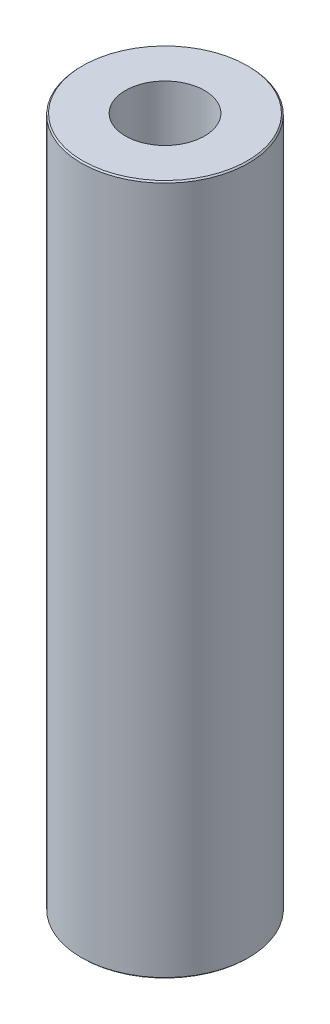
ISO-10303-21;
HEADER;
FILE_DESCRIPTION(('STEP AP214'),'2;1');
FILE_NAME('part.step','',(''),(''),'','','');
FILE_SCHEMA(('AUTOMOTIVE_DESIGN { 1 0 10303 214 1 1 1 1 }'));
ENDSEC;
DATA;
#1=APPLICATION_CONTEXT('core data for automotive mechanical design processes');
#2=APPLICATION_PROTOCOL_DEFINITION('international standard','automotive_design',2000,#1);
#3=PRODUCT_CONTEXT('',#1,'mechanical');
#4=PRODUCT('Part','Part','',(#3));
#5=PRODUCT_RELATED_PRODUCT_CATEGORY('part','',(#4));
#6=PRODUCT_DEFINITION_FORMATION('','',#4);
#7=PRODUCT_DEFINITION_CONTEXT('part definition',#1,'design');
#8=PRODUCT_DEFINITION('design','',#6,#7);
#9=PRODUCT_DEFINITION_SHAPE('','',#8);
#10=(LENGTH_UNIT() NAMED_UNIT(*) SI_UNIT(.MILLI.,.METRE.));
#11=(NAMED_UNIT(*) PLANE_ANGLE_UNIT() SI_UNIT($,.RADIAN.));
#12=(NAMED_UNIT(*) SI_UNIT($,.STERADIAN.) SOLID_ANGLE_UNIT());
#13=UNCERTAINTY_MEASURE_WITH_UNIT(LENGTH_MEASURE(1.E-05),#10,'distance_accuracy_value','');
#14=(GEOMETRIC_REPRESENTATION_CONTEXT(3) GLOBAL_UNCERTAINTY_ASSIGNED_CONTEXT((#13)) GLOBAL_UNIT_ASSIGNED_CONTEXT((#10,
#11,#12)) REPRESENTATION_CONTEXT('',''));
#15=CARTESIAN_POINT('',(0.,0.,0.));
#16=DIRECTION('',(0.,0.,1.));
#17=DIRECTION('',(1.,0.,0.));
#18=AXIS2_PLACEMENT_3D('',#15,#16,#17);
#19=CARTESIAN_POINT('',(0.,494.9899320301,0.));
#20=DIRECTION('',(0.,-1.,0.));
#21=DIRECTION('',(0.,0.,-1.));
#22=AXIS2_PLACEMENT_3D('',#19,#20,#21);
#23=CYLINDRICAL_SURFACE('',#22,60.);
#24=CARTESIAN_POINT('',(0.,494.030837993761,0.));
#25=DIRECTION('',(0.,1.,0.));
#26=DIRECTION('',(0.,0.,1.));
#27=AXIS2_PLACEMENT_3D('',#24,#25,#26);
#28=CIRCLE('',#27,60.);
#29=CARTESIAN_POINT('',(0.,494.030837993761,-60.));
#30=VERTEX_POINT('',#29);
#31=EDGE_CURVE('E50',#30,#30,#28,.F.);
#32=CARTESIAN_POINT('',(0.,0.959094036339536,0.));
#33=DIRECTION('',(0.,1.,0.));
#34=DIRECTION('',(0.,0.,1.));
#35=AXIS2_PLACEMENT_3D('',#32,#33,#34);
#36=CIRCLE('',#35,60.);
#37=CARTESIAN_POINT('',(0.,0.959094036339481,-60.));
#38=VERTEX_POINT('',#37);
#39=EDGE_CURVE('E51',#38,#38,#36,.T.);
#40=CARTESIAN_POINT('',(0.,494.030837993761,-60.));
#41=CARTESIAN_POINT('',(0.,488.894673994204,-60.));
#42=CARTESIAN_POINT('',(0.,483.758509994648,-60.));
#43=CARTESIAN_POINT('',(0.,473.486181995535,-60.));
#44=CARTESIAN_POINT('',(0.,468.350017995978,-60.));
#45=CARTESIAN_POINT('',(0.,458.077689996866,-60.));
#46=CARTESIAN_POINT('',(0.,452.941525997309,-60.));
#47=CARTESIAN_POINT('',(0.,442.669197998196,-60.));
#48=CARTESIAN_POINT('',(0.,437.53303399864,-60.));
#49=CARTESIAN_POINT('',(0.,427.260705999527,-60.));
#50=CARTESIAN_POINT('',(0.,422.12454199997,-60.));
#51=CARTESIAN_POINT('',(0.,411.852214000857,-60.));
#52=CARTESIAN_POINT('',(0.,406.716050001301,-60.));
#53=CARTESIAN_POINT('',(0.,396.443722002188,-60.));
#54=CARTESIAN_POINT('',(0.,391.307558002631,-60.));
#55=CARTESIAN_POINT('',(0.,381.035230003518,-60.));
#56=CARTESIAN_POINT('',(0.,375.899066003962,-60.));
#57=CARTESIAN_POINT('',(0.,365.626738004849,-60.));
#58=CARTESIAN_POINT('',(0.,360.490574005293,-60.));
#59=CARTESIAN_POINT('',(0.,350.21824600618,-60.));
#60=CARTESIAN_POINT('',(0.,345.082082006623,-60.));
#61=CARTESIAN_POINT('',(0.,334.80975400751,-60.));
#62=CARTESIAN_POINT('',(0.,329.673590007954,-60.));
#63=CARTESIAN_POINT('',(0.,319.401262008841,-60.));
#64=CARTESIAN_POINT('',(0.,314.265098009284,-60.));
#65=CARTESIAN_POINT('',(0.,303.992770010171,-60.));
#66=CARTESIAN_POINT('',(0.,298.856606010615,-60.));
#67=CARTESIAN_POINT('',(0.,288.584278011502,-60.));
#68=CARTESIAN_POINT('',(0.,283.448114011945,-60.));
#69=CARTESIAN_POINT('',(0.,273.175786012833,-60.));
#70=CARTESIAN_POINT('',(0.,268.039622013276,-60.));
#71=CARTESIAN_POINT('',(0.,257.767294014163,-60.));
#72=CARTESIAN_POINT('',(0.,252.631130014607,-60.));
#73=CARTESIAN_POINT('',(0.,242.358802015494,-60.));
#74=CARTESIAN_POINT('',(0.,237.222638015937,-60.));
#75=CARTESIAN_POINT('',(0.,226.950310016824,-60.));
#76=CARTESIAN_POINT('',(0.,221.814146017268,-60.));
#77=CARTESIAN_POINT('',(0.,211.541818018155,-60.));
#78=CARTESIAN_POINT('',(0.,206.405654018598,-60.));
#79=CARTESIAN_POINT('',(0.,196.133326019485,-60.));
#80=CARTESIAN_POINT('',(0.,190.997162019929,-60.));
#81=CARTESIAN_POINT('',(0.,180.724834020816,-60.));
#82=CARTESIAN_POINT('',(0.,175.58867002126,-60.));
#83=CARTESIAN_POINT('',(0.,165.316342022147,-60.));
#84=CARTESIAN_POINT('',(0.,160.18017802259,-60.));
#85=CARTESIAN_POINT('',(0.,149.907850023477,-60.));
#86=CARTESIAN_POINT('',(0.,144.771686023921,-60.));
#87=CARTESIAN_POINT('',(0.,134.499358024808,-60.));
#88=CARTESIAN_POINT('',(0.,129.363194025251,-60.));
#89=CARTESIAN_POINT('',(0.,119.090866026138,-60.));
#90=CARTESIAN_POINT('',(0.,113.954702026582,-60.));
#91=CARTESIAN_POINT('',(0.,103.682374027469,-60.));
#92=CARTESIAN_POINT('',(0.,98.5462100279125,-60.));
#93=CARTESIAN_POINT('',(0.,88.2738820287996,-60.));
#94=CARTESIAN_POINT('',(0.,83.1377180292431,-60.));
#95=CARTESIAN_POINT('',(0.,72.8653900301301,-60.));
#96=CARTESIAN_POINT('',(0.,67.7292260305736,-60.));
#97=CARTESIAN_POINT('',(0.,57.4568980314607,-60.));
#98=CARTESIAN_POINT('',(0.,52.3207340319042,-60.));
#99=CARTESIAN_POINT('',(0.,42.0484060327913,-60.));
#100=CARTESIAN_POINT('',(0.,36.9122420332348,-60.));
#101=CARTESIAN_POINT('',(0.,26.6399140341219,-60.));
#102=CARTESIAN_POINT('',(0.,21.5037500345654,-60.));
#103=CARTESIAN_POINT('',(0.,11.2314220354524,-60.));
#104=CARTESIAN_POINT('',(0.,6.09525803589596,-60.));
#105=CARTESIAN_POINT('',(0.,0.959094036339481,-60.));
#106=B_SPLINE_CURVE_WITH_KNOTS('',3,(#40,#41,#42,#43,#44,#45,#46,#47,#48,#49,#50,#51,#52,#53,
#54,#55,#56,#57,#58,#59,#60,#61,#62,#63,#64,#65,#66,#67,#68,#69,#70,#71,#72,#73,#74,#75,#76,#77,
#78,#79,#80,#81,#82,#83,#84,#85,#86,#87,#88,#89,#90,#91,#92,#93,#94,#95,#96,#97,#98,#99,#100,
#101,#102,#103,#104,#105),.UNSPECIFIED.,.F.,.F.,(4,2,2,2,2,2,2,2,2,2,2,2,2,2,2,2,2,2,2,2,2,2,2,
2,2,2,2,2,2,2,2,2,4),(0.,15.4084919986694,30.8169839973388,46.2254759960083,61.6339679946777,
77.0424599933471,92.4509519920165,107.859443990686,123.267935989355,138.676427988025,
154.084919986694,169.493411985364,184.901903984033,200.310395982702,215.718887981372,
231.127379980041,246.535871978711,261.94436397738,277.35285597605,292.761347974719,
308.169839973388,323.578331972058,338.986823970727,354.395315969397,369.803807968066,
385.212299966735,400.620791965405,416.029283964074,431.437775962744,446.846267961413,
462.254759960082,477.663251958752,493.071743957421),.UNSPECIFIED.);
#107=EDGE_CURVE('BSEAM39',#30,#38,#106,.T.);
#108=ORIENTED_EDGE('',*,*,#31,.T.);
#109=ORIENTED_EDGE('',*,*,#39,.T.);
#110=ORIENTED_EDGE('',*,*,#107,.T.);
#111=ORIENTED_EDGE('',*,*,#107,.F.);
#112=EDGE_LOOP('',(#108,#110,#109,#111));
#113=FACE_BOUND('',#112,.T.);
#114=ADVANCED_FACE('F39',(#113),#23,.T.);
#115=CARTESIAN_POINT('',(0.,494.9899320301,0.));
#116=DIRECTION('',(0.,1.,0.));
#117=DIRECTION('',(0.,0.,1.));
#118=AXIS2_PLACEMENT_3D('',#115,#116,#117);
#119=PLANE('',#118);
#120=CARTESIAN_POINT('',(0.,494.9899320301,0.));
#121=DIRECTION('',(0.,1.,0.));
#122=DIRECTION('',(0.,0.,1.));
#123=AXIS2_PLACEMENT_3D('',#120,#121,#122);
#124=CIRCLE('',#123,59.0409059636611);
#125=CARTESIAN_POINT('',(0.,494.9899320301,59.0409059636611));
#126=VERTEX_POINT('',#125);
#127=EDGE_CURVE('E54',#126,#126,#124,.T.);
#128=ORIENTED_EDGE('',*,*,#127,.T.);
#129=EDGE_LOOP('',(#128));
#130=FACE_BOUND('',#129,.T.);
#131=CARTESIAN_POINT('',(0.,494.9899320301,0.));
#132=DIRECTION('',(0.,1.,0.));
#133=DIRECTION('',(0.,0.,1.));
#134=AXIS2_PLACEMENT_3D('',#131,#132,#133);
#135=CIRCLE('',#134,28.333598425286);
#136=CARTESIAN_POINT('',(0.,494.9899320301,-28.333598425286));
#137=VERTEX_POINT('',#136);
#138=EDGE_CURVE('E58',#137,#137,#135,.T.);
#139=ORIENTED_EDGE('',*,*,#138,.F.);
#140=EDGE_LOOP('',(#139));
#141=FACE_BOUND('',#140,.T.);
#142=ADVANCED_FACE('F69',(#130,#141),#119,.T.);
#143=CARTESIAN_POINT('',(0.,0.,0.));
#144=DIRECTION('',(0.,1.,0.));
#145=DIRECTION('',(0.,0.,1.));
#146=AXIS2_PLACEMENT_3D('',#143,#144,#145);
#147=PLANE('',#146);
#148=CARTESIAN_POINT('',(0.,0.,0.));
#149=DIRECTION('',(0.,1.,0.));
#150=DIRECTION('',(0.,0.,1.));
#151=AXIS2_PLACEMENT_3D('',#148,#149,#150);
#152=CIRCLE('',#151,59.0409059636604);
#153=CARTESIAN_POINT('',(0.,0.,59.0409059636604));
#154=VERTEX_POINT('',#153);
#155=EDGE_CURVE('E10',#154,#154,#152,.F.);
#156=ORIENTED_EDGE('',*,*,#155,.T.);
#157=EDGE_LOOP('',(#156));
#158=FACE_BOUND('',#157,.T.);
#159=CARTESIAN_POINT('',(0.,0.,0.));
#160=DIRECTION('',(0.,1.,0.));
#161=DIRECTION('',(0.,0.,1.));
#162=AXIS2_PLACEMENT_3D('',#159,#160,#161);
#163=CIRCLE('',#162,28.333598425286);
#164=CARTESIAN_POINT('',(0.,0.,-28.333598425286));
#165=VERTEX_POINT('',#164);
#166=EDGE_CURVE('E63',#165,#165,#163,.T.);
#167=ORIENTED_EDGE('',*,*,#166,.T.);
#168=EDGE_LOOP('',(#167));
#169=FACE_BOUND('',#168,.T.);
#170=ADVANCED_FACE('F75',(#158,#169),#147,.F.);
#171=CARTESIAN_POINT('',(0.,494.9899320301,0.));
#172=DIRECTION('',(0.,-1.,0.));
#173=DIRECTION('',(0.,0.,-1.));
#174=AXIS2_PLACEMENT_3D('',#171,#172,#173);
#175=CYLINDRICAL_SURFACE('',#174,28.333598425286);
#176=CARTESIAN_POINT('',(0.,494.9899320301,-28.333598425286));
#177=CARTESIAN_POINT('',(0.,489.833786904786,-28.333598425286));
#178=CARTESIAN_POINT('',(0.,484.677641779473,-28.333598425286));
#179=CARTESIAN_POINT('',(0.,474.365351528845,-28.333598425286));
#180=CARTESIAN_POINT('',(0.,469.209206403532,-28.333598425286));
#181=CARTESIAN_POINT('',(0.,458.896916152905,-28.333598425286));
#182=CARTESIAN_POINT('',(0.,453.740771027591,-28.333598425286));
#183=CARTESIAN_POINT('',(0.,443.428480776964,-28.333598425286));
#184=CARTESIAN_POINT('',(0.,438.272335651651,-28.333598425286));
#185=CARTESIAN_POINT('',(0.,427.960045401024,-28.333598425286));
#186=CARTESIAN_POINT('',(0.,422.80390027571,-28.333598425286));
#187=CARTESIAN_POINT('',(0.,412.491610025083,-28.333598425286));
#188=CARTESIAN_POINT('',(0.,407.335464899769,-28.333598425286));
#189=CARTESIAN_POINT('',(0.,397.023174649142,-28.333598425286));
#190=CARTESIAN_POINT('',(0.,391.867029523829,-28.333598425286));
#191=CARTESIAN_POINT('',(0.,381.554739273202,-28.333598425286));
#192=CARTESIAN_POINT('',(0.,376.398594147888,-28.333598425286));
#193=CARTESIAN_POINT('',(0.,366.086303897261,-28.333598425286));
#194=CARTESIAN_POINT('',(0.,360.930158771948,-28.333598425286));
#195=CARTESIAN_POINT('',(0.,350.617868521321,-28.333598425286));
#196=CARTESIAN_POINT('',(0.,345.461723396007,-28.333598425286));
#197=CARTESIAN_POINT('',(0.,335.14943314538,-28.333598425286));
#198=CARTESIAN_POINT('',(0.,329.993288020066,-28.333598425286));
#199=CARTESIAN_POINT('',(0.,319.680997769439,-28.333598425286));
#200=CARTESIAN_POINT('',(0.,314.524852644126,-28.333598425286));
#201=CARTESIAN_POINT('',(0.,304.212562393499,-28.333598425286));
#202=CARTESIAN_POINT('',(0.,299.056417268185,-28.333598425286));
#203=CARTESIAN_POINT('',(0.,288.744127017558,-28.333598425286));
#204=CARTESIAN_POINT('',(0.,283.587981892245,-28.333598425286));
#205=CARTESIAN_POINT('',(0.,273.275691641617,-28.333598425286));
#206=CARTESIAN_POINT('',(0.,268.119546516304,-28.333598425286));
#207=CARTESIAN_POINT('',(0.,257.807256265677,-28.333598425286));
#208=CARTESIAN_POINT('',(0.,252.651111140363,-28.333598425286));
#209=CARTESIAN_POINT('',(0.,242.338820889736,-28.333598425286));
#210=CARTESIAN_POINT('',(0.,237.182675764423,-28.333598425286));
#211=CARTESIAN_POINT('',(0.,226.870385513796,-28.333598425286));
#212=CARTESIAN_POINT('',(0.,221.714240388482,-28.333598425286));
#213=CARTESIAN_POINT('',(0.,211.401950137855,-28.333598425286));
#214=CARTESIAN_POINT('',(0.,206.245805012542,-28.333598425286));
#215=CARTESIAN_POINT('',(0.,195.933514761914,-28.333598425286));
#216=CARTESIAN_POINT('',(0.,190.777369636601,-28.333598425286));
#217=CARTESIAN_POINT('',(0.,180.465079385974,-28.333598425286));
#218=CARTESIAN_POINT('',(0.,175.30893426066,-28.333598425286));
#219=CARTESIAN_POINT('',(0.,164.996644010033,-28.333598425286));
#220=CARTESIAN_POINT('',(0.,159.84049888472,-28.333598425286));
#221=CARTESIAN_POINT('',(0.,149.528208634093,-28.333598425286));
#222=CARTESIAN_POINT('',(0.,144.372063508779,-28.333598425286));
#223=CARTESIAN_POINT('',(0.,134.059773258152,-28.333598425286));
#224=CARTESIAN_POINT('',(0.,128.903628132838,-28.333598425286));
#225=CARTESIAN_POINT('',(0.,118.591337882211,-28.333598425286));
#226=CARTESIAN_POINT('',(0.,113.435192756898,-28.333598425286));
#227=CARTESIAN_POINT('',(0.,103.122902506271,-28.333598425286));
#228=CARTESIAN_POINT('',(0.,97.9667573809572,-28.333598425286));
#229=CARTESIAN_POINT('',(0.,87.6544671303301,-28.333598425286));
#230=CARTESIAN_POINT('',(0.,82.4983220050166,-28.333598425286));
#231=CARTESIAN_POINT('',(0.,72.1860317543895,-28.333598425286));
#232=CARTESIAN_POINT('',(0.,67.0298866290759,-28.333598425286));
#233=CARTESIAN_POINT('',(0.,56.7175963784489,-28.333598425286));
#234=CARTESIAN_POINT('',(0.,51.5614512531353,-28.333598425286));
#235=CARTESIAN_POINT('',(0.,41.2491610025083,-28.333598425286));
#236=CARTESIAN_POINT('',(0.,36.0930158771947,-28.333598425286));
#237=CARTESIAN_POINT('',(0.,25.7807256265676,-28.333598425286));
#238=CARTESIAN_POINT('',(0.,20.6245805012541,-28.333598425286));
#239=CARTESIAN_POINT('',(0.,10.312290250627,-28.333598425286));
#240=CARTESIAN_POINT('',(0.,5.15614512531348,-28.333598425286));
#241=CARTESIAN_POINT('',(0.,0.,-28.333598425286));
#242=B_SPLINE_CURVE_WITH_KNOTS('',3,(#176,#177,#178,#179,#180,#181,#182,#183,#184,#185,#186,
#187,#188,#189,#190,#191,#192,#193,#194,#195,#196,#197,#198,#199,#200,#201,#202,#203,#204,#205,
#206,#207,#208,#209,#210,#211,#212,#213,#214,#215,#216,#217,#218,#219,#220,#221,#222,#223,#224,
#225,#226,#227,#228,#229,#230,#231,#232,#233,#234,#235,#236,#237,#238,#239,#240,#241),
.UNSPECIFIED.,.F.,.F.,(4,2,2,2,2,2,2,2,2,2,2,2,2,2,2,2,2,2,2,2,2,2,2,2,2,2,2,2,2,2,2,2,4),(0.,
15.4684353759407,30.9368707518813,46.4053061278219,61.8737415037625,77.3421768797031,
92.8106122556437,108.279047631584,123.747483007525,139.215918383466,154.684353759406,
170.152789135347,185.621224511287,201.089659887228,216.558095263169,232.026530639109,
247.49496601505,262.96340139099,278.431836766931,293.900272142872,309.368707518812,
324.837142894753,340.305578270694,355.774013646634,371.242449022575,386.710884398515,
402.179319774456,417.647755150397,433.116190526337,448.584625902278,464.053061278218,
479.521496654159,494.9899320301),.UNSPECIFIED.);
#243=EDGE_CURVE('BSEAM70',#137,#165,#242,.T.);
#244=ORIENTED_EDGE('',*,*,#138,.T.);
#245=ORIENTED_EDGE('',*,*,#166,.F.);
#246=ORIENTED_EDGE('',*,*,#243,.T.);
#247=ORIENTED_EDGE('',*,*,#243,.F.);
#248=EDGE_LOOP('',(#244,#246,#245,#247));
#249=FACE_BOUND('',#248,.T.);
#250=ADVANCED_FACE('F70',(#249),#175,.F.);
#251=CARTESIAN_POINT('',(0.,494.9899320301,0.));
#252=DIRECTION('',(0.,-1.,0.));
#253=DIRECTION('',(0.,0.,-1.));
#254=AXIS2_PLACEMENT_3D('',#251,#252,#253);
#255=CONICAL_SURFACE('',#254,59.0409059636611,0.785398163397481);
#256=ORIENTED_EDGE('',*,*,#31,.F.);
#257=EDGE_LOOP('',(#256));
#258=FACE_BOUND('',#257,.T.);
#259=ORIENTED_EDGE('',*,*,#127,.F.);
#260=EDGE_LOOP('',(#259));
#261=FACE_BOUND('',#260,.T.);
#262=ADVANCED_FACE('F81',(#258,#261),#255,.T.);
#263=CARTESIAN_POINT('',(0.,0.959094036339536,0.));
#264=DIRECTION('',(0.,1.,0.));
#265=DIRECTION('',(0.,0.,1.));
#266=AXIS2_PLACEMENT_3D('',#263,#264,#265);
#267=CONICAL_SURFACE('',#266,60.,0.785398163397455);
#268=ORIENTED_EDGE('',*,*,#155,.F.);
#269=EDGE_LOOP('',(#268));
#270=FACE_BOUND('',#269,.T.);
#271=ORIENTED_EDGE('',*,*,#39,.F.);
#272=EDGE_LOOP('',(#271));
#273=FACE_BOUND('',#272,.T.);
#274=ADVANCED_FACE('F45',(#270,#273),#267,.T.);
#275=CLOSED_SHELL('',(#114,#142,#170,#250,#262,#274));
#276=MANIFOLD_SOLID_BREP('B2',#275);
#277=ADVANCED_BREP_SHAPE_REPRESENTATION('',(#18,#276),#14);
#278=SHAPE_DEFINITION_REPRESENTATION(#9,#277);
ENDSEC;
END-ISO-10303-21;
